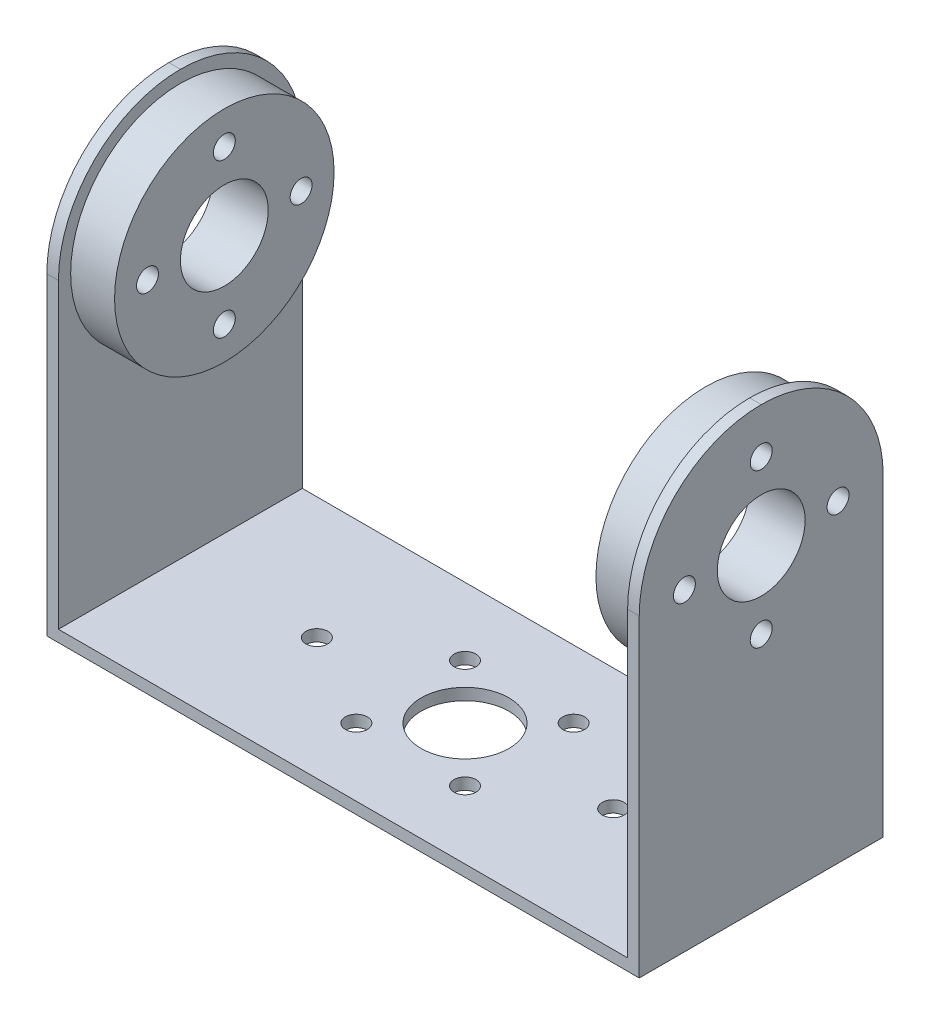
ISO-10303-21;
HEADER;
FILE_DESCRIPTION(('STEP AP214'),'2;1');
FILE_NAME('part.step','',(''),(''),'','','');
FILE_SCHEMA(('AUTOMOTIVE_DESIGN { 1 0 10303 214 1 1 1 1 }'));
ENDSEC;
DATA;
#1=APPLICATION_CONTEXT('core data for automotive mechanical design processes');
#2=APPLICATION_PROTOCOL_DEFINITION('international standard','automotive_design',2000,#1);
#3=PRODUCT_CONTEXT('',#1,'mechanical');
#4=PRODUCT('Part','Part','',(#3));
#5=PRODUCT_RELATED_PRODUCT_CATEGORY('part','',(#4));
#6=PRODUCT_DEFINITION_FORMATION('','',#4);
#7=PRODUCT_DEFINITION_CONTEXT('part definition',#1,'design');
#8=PRODUCT_DEFINITION('design','',#6,#7);
#9=PRODUCT_DEFINITION_SHAPE('','',#8);
#10=(LENGTH_UNIT() NAMED_UNIT(*) SI_UNIT(.MILLI.,.METRE.));
#11=(NAMED_UNIT(*) PLANE_ANGLE_UNIT() SI_UNIT($,.RADIAN.));
#12=(NAMED_UNIT(*) SI_UNIT($,.STERADIAN.) SOLID_ANGLE_UNIT());
#13=UNCERTAINTY_MEASURE_WITH_UNIT(LENGTH_MEASURE(1.E-05),#10,'distance_accuracy_value','');
#14=(GEOMETRIC_REPRESENTATION_CONTEXT(3) GLOBAL_UNCERTAINTY_ASSIGNED_CONTEXT((#13)) GLOBAL_UNIT_ASSIGNED_CONTEXT((#10,
#11,#12)) REPRESENTATION_CONTEXT('',''));
#15=CARTESIAN_POINT('',(0.,0.,0.));
#16=DIRECTION('',(0.,0.,1.));
#17=DIRECTION('',(1.,0.,0.));
#18=AXIS2_PLACEMENT_3D('',#15,#16,#17);
#19=CARTESIAN_POINT('',(1.05833333333333,1.05833333333333,22.225));
#20=DIRECTION('',(-1.,0.,0.));
#21=DIRECTION('',(0.,0.,1.));
#22=AXIS2_PLACEMENT_3D('',#19,#20,#21);
#23=PLANE('',#22);
#24=DIRECTION('',(0.,1.,0.));
#25=VECTOR('',#24,1.);
#26=CARTESIAN_POINT('',(1.05833333333333,1.05833333333333,0.));
#27=LINE('',#26,#25);
#28=CARTESIAN_POINT('',(1.05833333333333,1.05833333333333,0.));
#29=VERTEX_POINT('',#28);
#30=CARTESIAN_POINT('',(1.05833333333333,28.575,0.));
#31=VERTEX_POINT('',#30);
#32=EDGE_CURVE('E120',#29,#31,#27,.T.);
#33=ORIENTED_EDGE('',*,*,#32,.T.);
#34=CARTESIAN_POINT('',(1.05833333333333,28.575,11.1125));
#35=DIRECTION('',(-1.,0.,0.));
#36=DIRECTION('',(0.,0.,1.));
#37=AXIS2_PLACEMENT_3D('',#34,#35,#36);
#38=CIRCLE('',#37,11.1125);
#39=CARTESIAN_POINT('',(1.05833333333333,39.6875,11.1125));
#40=VERTEX_POINT('',#39);
#41=EDGE_CURVE('E176',#31,#40,#38,.F.);
#42=ORIENTED_EDGE('',*,*,#41,.T.);
#43=CARTESIAN_POINT('',(1.05833333333333,28.575,11.1125));
#44=DIRECTION('',(-1.,0.,0.));
#45=DIRECTION('',(0.,0.,1.));
#46=AXIS2_PLACEMENT_3D('',#43,#44,#45);
#47=CIRCLE('',#46,11.1125);
#48=CARTESIAN_POINT('',(1.05833333333333,28.575,22.225));
#49=VERTEX_POINT('',#48);
#50=EDGE_CURVE('E174',#40,#49,#47,.F.);
#51=ORIENTED_EDGE('',*,*,#50,.T.);
#52=DIRECTION('',(0.,1.,0.));
#53=VECTOR('',#52,1.);
#54=CARTESIAN_POINT('',(1.05833333333333,1.05833333333333,22.225));
#55=LINE('',#54,#53);
#56=CARTESIAN_POINT('',(1.05833333333333,1.05833333333333,22.225));
#57=VERTEX_POINT('',#56);
#58=EDGE_CURVE('E144',#57,#49,#55,.T.);
#59=ORIENTED_EDGE('',*,*,#58,.F.);
#60=DIRECTION('',(0.,0.,-1.));
#61=VECTOR('',#60,1.);
#62=CARTESIAN_POINT('',(1.05833333333333,1.05833333333333,22.225));
#63=LINE('',#62,#61);
#64=EDGE_CURVE('E146',#57,#29,#63,.T.);
#65=ORIENTED_EDGE('',*,*,#64,.T.);
#66=EDGE_LOOP('',(#33,#42,#51,#59,#65));
#67=FACE_BOUND('',#66,.T.);
#68=CARTESIAN_POINT('',(1.05833333333333,28.575,11.1125));
#69=DIRECTION('',(-1.,0.,0.));
#70=DIRECTION('',(0.,0.,1.));
#71=AXIS2_PLACEMENT_3D('',#68,#69,#70);
#72=CIRCLE('',#71,10.);
#73=CARTESIAN_POINT('',(1.05833333333333,28.575,21.1125));
#74=VERTEX_POINT('',#73);
#75=EDGE_CURVE('E11',#74,#74,#72,.F.);
#76=ORIENTED_EDGE('',*,*,#75,.F.);
#77=EDGE_LOOP('',(#76));
#78=FACE_BOUND('',#77,.T.);
#79=ADVANCED_FACE('F32',(#67,#78),#23,.F.);
#80=CARTESIAN_POINT('',(0.,39.6875,22.225));
#81=DIRECTION('',(1.,0.,0.));
#82=DIRECTION('',(0.,0.,-1.));
#83=AXIS2_PLACEMENT_3D('',#80,#81,#82);
#84=PLANE('',#83);
#85=CARTESIAN_POINT('',(0.,28.5750000000001,4.1125));
#86=DIRECTION('',(1.,0.,0.));
#87=DIRECTION('',(0.,0.,-1.));
#88=AXIS2_PLACEMENT_3D('',#85,#86,#87);
#89=CIRCLE('',#88,1.);
#90=CARTESIAN_POINT('',(0.,28.5750000000001,3.1125));
#91=VERTEX_POINT('',#90);
#92=EDGE_CURVE('E448',#91,#91,#89,.F.);
#93=ORIENTED_EDGE('',*,*,#92,.F.);
#94=EDGE_LOOP('',(#93));
#95=FACE_BOUND('',#94,.T.);
#96=CARTESIAN_POINT('',(0.,28.575,18.1125));
#97=DIRECTION('',(1.,0.,0.));
#98=DIRECTION('',(0.,0.,-1.));
#99=AXIS2_PLACEMENT_3D('',#96,#97,#98);
#100=CIRCLE('',#99,1.);
#101=CARTESIAN_POINT('',(0.,28.575,17.1125));
#102=VERTEX_POINT('',#101);
#103=EDGE_CURVE('E205',#102,#102,#100,.F.);
#104=ORIENTED_EDGE('',*,*,#103,.F.);
#105=EDGE_LOOP('',(#104));
#106=FACE_BOUND('',#105,.T.);
#107=CARTESIAN_POINT('',(0.,21.575,11.1125));
#108=DIRECTION('',(1.,0.,0.));
#109=DIRECTION('',(0.,0.,-1.));
#110=AXIS2_PLACEMENT_3D('',#107,#108,#109);
#111=CIRCLE('',#110,1.);
#112=CARTESIAN_POINT('',(0.,21.575,10.1125));
#113=VERTEX_POINT('',#112);
#114=EDGE_CURVE('E447',#113,#113,#111,.F.);
#115=ORIENTED_EDGE('',*,*,#114,.F.);
#116=EDGE_LOOP('',(#115));
#117=FACE_BOUND('',#116,.T.);
#118=CARTESIAN_POINT('',(0.,28.575,11.1125));
#119=DIRECTION('',(1.,0.,0.));
#120=DIRECTION('',(0.,0.,-1.));
#121=AXIS2_PLACEMENT_3D('',#118,#119,#120);
#122=CIRCLE('',#121,4.);
#123=CARTESIAN_POINT('',(0.,28.575,7.1125));
#124=VERTEX_POINT('',#123);
#125=EDGE_CURVE('E190',#124,#124,#122,.F.);
#126=ORIENTED_EDGE('',*,*,#125,.F.);
#127=EDGE_LOOP('',(#126));
#128=FACE_BOUND('',#127,.T.);
#129=CARTESIAN_POINT('',(0.,35.575,11.1125));
#130=DIRECTION('',(1.,0.,0.));
#131=DIRECTION('',(0.,0.,-1.));
#132=AXIS2_PLACEMENT_3D('',#129,#130,#131);
#133=CIRCLE('',#132,1.);
#134=CARTESIAN_POINT('',(0.,35.575,10.1125));
#135=VERTEX_POINT('',#134);
#136=EDGE_CURVE('E199',#135,#135,#133,.F.);
#137=ORIENTED_EDGE('',*,*,#136,.F.);
#138=EDGE_LOOP('',(#137));
#139=FACE_BOUND('',#138,.T.);
#140=CARTESIAN_POINT('',(0.,28.575,11.1125));
#141=DIRECTION('',(1.,0.,0.));
#142=DIRECTION('',(0.,0.,-1.));
#143=AXIS2_PLACEMENT_3D('',#140,#141,#142);
#144=CIRCLE('',#143,11.1125);
#145=CARTESIAN_POINT('',(0.,28.575,22.225));
#146=VERTEX_POINT('',#145);
#147=CARTESIAN_POINT('',(0.,39.6875,11.1125));
#148=VERTEX_POINT('',#147);
#149=EDGE_CURVE('E129',#146,#148,#144,.F.);
#150=ORIENTED_EDGE('',*,*,#149,.T.);
#151=CARTESIAN_POINT('',(0.,28.575,11.1125));
#152=DIRECTION('',(1.,0.,0.));
#153=DIRECTION('',(0.,0.,-1.));
#154=AXIS2_PLACEMENT_3D('',#151,#152,#153);
#155=CIRCLE('',#154,11.1125);
#156=CARTESIAN_POINT('',(0.,28.575,0.));
#157=VERTEX_POINT('',#156);
#158=EDGE_CURVE('E166',#148,#157,#155,.F.);
#159=ORIENTED_EDGE('',*,*,#158,.T.);
#160=DIRECTION('',(0.,-1.,0.));
#161=VECTOR('',#160,1.);
#162=CARTESIAN_POINT('',(0.,39.6875,0.));
#163=LINE('',#162,#161);
#164=CARTESIAN_POINT('',(0.,0.,0.));
#165=VERTEX_POINT('',#164);
#166=EDGE_CURVE('E126',#157,#165,#163,.T.);
#167=ORIENTED_EDGE('',*,*,#166,.T.);
#168=DIRECTION('',(0.,0.,-1.));
#169=VECTOR('',#168,1.);
#170=CARTESIAN_POINT('',(0.,0.,22.225));
#171=LINE('',#170,#169);
#172=CARTESIAN_POINT('',(0.,0.,22.225));
#173=VERTEX_POINT('',#172);
#174=EDGE_CURVE('E123',#173,#165,#171,.T.);
#175=ORIENTED_EDGE('',*,*,#174,.F.);
#176=DIRECTION('',(0.,-1.,0.));
#177=VECTOR('',#176,1.);
#178=CARTESIAN_POINT('',(0.,39.6875,22.225));
#179=LINE('',#178,#177);
#180=EDGE_CURVE('E108',#146,#173,#179,.T.);
#181=ORIENTED_EDGE('',*,*,#180,.F.);
#182=EDGE_LOOP('',(#150,#159,#167,#175,#181));
#183=FACE_BOUND('',#182,.T.);
#184=ADVANCED_FACE('F124',(#95,#106,#117,#128,#139,#183),#84,.F.);
#185=CARTESIAN_POINT('',(0.,0.,22.225));
#186=DIRECTION('',(0.,1.,0.));
#187=DIRECTION('',(0.,0.,1.));
#188=AXIS2_PLACEMENT_3D('',#185,#186,#187);
#189=PLANE('',#188);
#190=CARTESIAN_POINT('',(13.4875,0.,11.1125));
#191=DIRECTION('',(0.,-1.,0.));
#192=DIRECTION('',(0.,0.,-1.));
#193=AXIS2_PLACEMENT_3D('',#190,#191,#192);
#194=CIRCLE('',#193,0.999999999999999);
#195=CARTESIAN_POINT('',(13.4875,0.,10.1125));
#196=VERTEX_POINT('',#195);
#197=EDGE_CURVE('E405',#196,#196,#194,.T.);
#198=ORIENTED_EDGE('',*,*,#197,.F.);
#199=EDGE_LOOP('',(#198));
#200=FACE_BOUND('',#199,.T.);
#201=CARTESIAN_POINT('',(40.4875,0.,11.1125));
#202=DIRECTION('',(0.,-1.,0.));
#203=DIRECTION('',(0.,0.,-1.));
#204=AXIS2_PLACEMENT_3D('',#201,#202,#203);
#205=CIRCLE('',#204,0.999999999999998);
#206=CARTESIAN_POINT('',(40.4875,0.,10.1125));
#207=VERTEX_POINT('',#206);
#208=EDGE_CURVE('E404',#207,#207,#205,.T.);
#209=ORIENTED_EDGE('',*,*,#208,.F.);
#210=EDGE_LOOP('',(#209));
#211=FACE_BOUND('',#210,.T.);
#212=CARTESIAN_POINT('',(31.9372474683059,0.,16.0622474683058));
#213=DIRECTION('',(0.,-1.,0.));
#214=DIRECTION('',(0.,0.,1.));
#215=AXIS2_PLACEMENT_3D('',#212,#213,#214);
#216=CIRCLE('',#215,0.999999999999999);
#217=CARTESIAN_POINT('',(31.9372474683059,0.,17.0622474683058));
#218=VERTEX_POINT('',#217);
#219=EDGE_CURVE('E422',#218,#218,#216,.T.);
#220=ORIENTED_EDGE('',*,*,#219,.F.);
#221=EDGE_LOOP('',(#220));
#222=FACE_BOUND('',#221,.T.);
#223=CARTESIAN_POINT('',(31.9372474683058,0.,6.16275253169416));
#224=DIRECTION('',(0.,-1.,0.));
#225=DIRECTION('',(1.,0.,0.));
#226=AXIS2_PLACEMENT_3D('',#223,#224,#225);
#227=CIRCLE('',#226,0.999999999999999);
#228=CARTESIAN_POINT('',(32.9372474683058,0.,6.16275253169417));
#229=VERTEX_POINT('',#228);
#230=EDGE_CURVE('E428',#229,#229,#227,.T.);
#231=ORIENTED_EDGE('',*,*,#230,.F.);
#232=EDGE_LOOP('',(#231));
#233=FACE_BOUND('',#232,.T.);
#234=CARTESIAN_POINT('',(22.0377525316941,0.,16.0622474683058));
#235=DIRECTION('',(0.,-1.,0.));
#236=DIRECTION('',(-1.,0.,0.));
#237=AXIS2_PLACEMENT_3D('',#234,#235,#236);
#238=CIRCLE('',#237,0.999999999999999);
#239=CARTESIAN_POINT('',(21.0377525316941,0.,16.0622474683058));
#240=VERTEX_POINT('',#239);
#241=EDGE_CURVE('E412',#240,#240,#238,.T.);
#242=ORIENTED_EDGE('',*,*,#241,.F.);
#243=EDGE_LOOP('',(#242));
#244=FACE_BOUND('',#243,.T.);
#245=CARTESIAN_POINT('',(22.0377525316941,0.,6.16275253169419));
#246=DIRECTION('',(0.,-1.,0.));
#247=DIRECTION('',(0.,0.,-1.));
#248=AXIS2_PLACEMENT_3D('',#245,#246,#247);
#249=CIRCLE('',#248,0.999999999999999);
#250=CARTESIAN_POINT('',(22.0377525316941,0.,5.16275253169419));
#251=VERTEX_POINT('',#250);
#252=EDGE_CURVE('E434',#251,#251,#249,.T.);
#253=ORIENTED_EDGE('',*,*,#252,.F.);
#254=EDGE_LOOP('',(#253));
#255=FACE_BOUND('',#254,.T.);
#256=CARTESIAN_POINT('',(26.9875,0.,11.1125));
#257=DIRECTION('',(0.,-1.,0.));
#258=DIRECTION('',(0.,0.,-1.));
#259=AXIS2_PLACEMENT_3D('',#256,#257,#258);
#260=CIRCLE('',#259,4.);
#261=CARTESIAN_POINT('',(26.9875,0.,7.1125));
#262=VERTEX_POINT('',#261);
#263=EDGE_CURVE('E440',#262,#262,#260,.T.);
#264=ORIENTED_EDGE('',*,*,#263,.F.);
#265=EDGE_LOOP('',(#264));
#266=FACE_BOUND('',#265,.T.);
#267=DIRECTION('',(1.,0.,0.));
#268=VECTOR('',#267,1.);
#269=CARTESIAN_POINT('',(0.,0.,0.));
#270=LINE('',#269,#268);
#271=CARTESIAN_POINT('',(53.975,0.,0.));
#272=VERTEX_POINT('',#271);
#273=EDGE_CURVE('E148',#165,#272,#270,.T.);
#274=ORIENTED_EDGE('',*,*,#273,.T.);
#275=DIRECTION('',(0.,0.,-1.));
#276=VECTOR('',#275,1.);
#277=CARTESIAN_POINT('',(53.975,0.,22.225));
#278=LINE('',#277,#276);
#279=CARTESIAN_POINT('',(53.975,0.,22.225));
#280=VERTEX_POINT('',#279);
#281=EDGE_CURVE('E130',#280,#272,#278,.T.);
#282=ORIENTED_EDGE('',*,*,#281,.F.);
#283=DIRECTION('',(1.,0.,0.));
#284=VECTOR('',#283,1.);
#285=CARTESIAN_POINT('',(0.,0.,22.225));
#286=LINE('',#285,#284);
#287=EDGE_CURVE('E114',#173,#280,#286,.T.);
#288=ORIENTED_EDGE('',*,*,#287,.F.);
#289=ORIENTED_EDGE('',*,*,#174,.T.);
#290=EDGE_LOOP('',(#274,#282,#288,#289));
#291=FACE_BOUND('',#290,.T.);
#292=ADVANCED_FACE('F132',(#200,#211,#222,#233,#244,#255,#266,#291),#189,.F.);
#293=CARTESIAN_POINT('',(53.975,0.,22.225));
#294=DIRECTION('',(-1.,0.,0.));
#295=DIRECTION('',(0.,0.,1.));
#296=AXIS2_PLACEMENT_3D('',#293,#294,#295);
#297=PLANE('',#296);
#298=CARTESIAN_POINT('',(53.975,28.5750000000001,4.1125));
#299=DIRECTION('',(1.,0.,0.));
#300=DIRECTION('',(0.,-1.,0.));
#301=AXIS2_PLACEMENT_3D('',#298,#299,#300);
#302=CIRCLE('',#301,1.);
#303=CARTESIAN_POINT('',(53.975,27.5750000000001,4.11249999999999));
#304=VERTEX_POINT('',#303);
#305=EDGE_CURVE('E349',#304,#304,#302,.T.);
#306=ORIENTED_EDGE('',*,*,#305,.F.);
#307=EDGE_LOOP('',(#306));
#308=FACE_BOUND('',#307,.T.);
#309=CARTESIAN_POINT('',(53.975,28.575,18.1125));
#310=DIRECTION('',(1.,0.,0.));
#311=DIRECTION('',(0.,1.,0.));
#312=AXIS2_PLACEMENT_3D('',#309,#310,#311);
#313=CIRCLE('',#312,1.);
#314=CARTESIAN_POINT('',(53.975,29.575,18.1125));
#315=VERTEX_POINT('',#314);
#316=EDGE_CURVE('E353',#315,#315,#313,.T.);
#317=ORIENTED_EDGE('',*,*,#316,.F.);
#318=EDGE_LOOP('',(#317));
#319=FACE_BOUND('',#318,.T.);
#320=CARTESIAN_POINT('',(53.975,21.575,11.1125));
#321=DIRECTION('',(1.,0.,0.));
#322=DIRECTION('',(0.,0.,1.));
#323=AXIS2_PLACEMENT_3D('',#320,#321,#322);
#324=CIRCLE('',#323,1.);
#325=CARTESIAN_POINT('',(53.975,21.575,12.1125));
#326=VERTEX_POINT('',#325);
#327=EDGE_CURVE('E357',#326,#326,#324,.T.);
#328=ORIENTED_EDGE('',*,*,#327,.F.);
#329=EDGE_LOOP('',(#328));
#330=FACE_BOUND('',#329,.T.);
#331=CARTESIAN_POINT('',(53.975,28.575,11.1125));
#332=DIRECTION('',(1.,0.,0.));
#333=DIRECTION('',(0.,0.,-1.));
#334=AXIS2_PLACEMENT_3D('',#331,#332,#333);
#335=CIRCLE('',#334,4.);
#336=CARTESIAN_POINT('',(53.975,28.575,7.1125));
#337=VERTEX_POINT('',#336);
#338=EDGE_CURVE('E194',#337,#337,#335,.T.);
#339=ORIENTED_EDGE('',*,*,#338,.F.);
#340=EDGE_LOOP('',(#339));
#341=FACE_BOUND('',#340,.T.);
#342=CARTESIAN_POINT('',(53.975,35.575,11.1125));
#343=DIRECTION('',(1.,0.,0.));
#344=DIRECTION('',(0.,0.,-1.));
#345=AXIS2_PLACEMENT_3D('',#342,#343,#344);
#346=CIRCLE('',#345,1.);
#347=CARTESIAN_POINT('',(53.975,35.575,10.1125));
#348=VERTEX_POINT('',#347);
#349=EDGE_CURVE('E203',#348,#348,#346,.T.);
#350=ORIENTED_EDGE('',*,*,#349,.F.);
#351=EDGE_LOOP('',(#350));
#352=FACE_BOUND('',#351,.T.);
#353=DIRECTION('',(0.,1.,0.));
#354=VECTOR('',#353,1.);
#355=CARTESIAN_POINT('',(53.975,0.,0.));
#356=LINE('',#355,#354);
#357=CARTESIAN_POINT('',(53.975,28.575,0.));
#358=VERTEX_POINT('',#357);
#359=EDGE_CURVE('E151',#272,#358,#356,.T.);
#360=ORIENTED_EDGE('',*,*,#359,.T.);
#361=CARTESIAN_POINT('',(53.975,28.575,11.1125));
#362=DIRECTION('',(-1.,0.,0.));
#363=DIRECTION('',(0.,0.,1.));
#364=AXIS2_PLACEMENT_3D('',#361,#362,#363);
#365=CIRCLE('',#364,11.1125);
#366=CARTESIAN_POINT('',(53.975,39.6875,11.1125));
#367=VERTEX_POINT('',#366);
#368=EDGE_CURVE('E40',#358,#367,#365,.F.);
#369=ORIENTED_EDGE('',*,*,#368,.T.);
#370=CARTESIAN_POINT('',(53.975,28.575,11.1125));
#371=DIRECTION('',(-1.,0.,0.));
#372=DIRECTION('',(0.,0.,1.));
#373=AXIS2_PLACEMENT_3D('',#370,#371,#372);
#374=CIRCLE('',#373,11.1125);
#375=CARTESIAN_POINT('',(53.975,28.575,22.225));
#376=VERTEX_POINT('',#375);
#377=EDGE_CURVE('E184',#367,#376,#374,.F.);
#378=ORIENTED_EDGE('',*,*,#377,.T.);
#379=DIRECTION('',(0.,1.,0.));
#380=VECTOR('',#379,1.);
#381=CARTESIAN_POINT('',(53.975,0.,22.225));
#382=LINE('',#381,#380);
#383=EDGE_CURVE('E135',#280,#376,#382,.T.);
#384=ORIENTED_EDGE('',*,*,#383,.F.);
#385=ORIENTED_EDGE('',*,*,#281,.T.);
#386=EDGE_LOOP('',(#360,#369,#378,#384,#385));
#387=FACE_BOUND('',#386,.T.);
#388=ADVANCED_FACE('F219',(#308,#319,#330,#341,#352,#387),#297,.F.);
#389=CARTESIAN_POINT('',(52.9166666666667,39.6875,22.225));
#390=DIRECTION('',(1.,0.,0.));
#391=DIRECTION('',(0.,1.,0.));
#392=AXIS2_PLACEMENT_3D('',#389,#390,#391);
#393=PLANE('',#392);
#394=CARTESIAN_POINT('',(52.9166666666667,28.575,11.1125));
#395=DIRECTION('',(1.,0.,0.));
#396=DIRECTION('',(0.,0.,-1.));
#397=AXIS2_PLACEMENT_3D('',#394,#395,#396);
#398=CIRCLE('',#397,10.);
#399=CARTESIAN_POINT('',(52.9166666666667,28.575,1.1125));
#400=VERTEX_POINT('',#399);
#401=EDGE_CURVE('E380',#400,#400,#398,.T.);
#402=ORIENTED_EDGE('',*,*,#401,.T.);
#403=EDGE_LOOP('',(#402));
#404=FACE_BOUND('',#403,.T.);
#405=CARTESIAN_POINT('',(52.9166666666667,28.575,11.1125));
#406=DIRECTION('',(1.,0.,0.));
#407=DIRECTION('',(0.,1.,0.));
#408=AXIS2_PLACEMENT_3D('',#405,#406,#407);
#409=CIRCLE('',#408,11.1125);
#410=CARTESIAN_POINT('',(52.9166666666667,28.575,22.225));
#411=VERTEX_POINT('',#410);
#412=CARTESIAN_POINT('',(52.9166666666667,39.6875,11.1125));
#413=VERTEX_POINT('',#412);
#414=EDGE_CURVE('E54',#411,#413,#409,.F.);
#415=ORIENTED_EDGE('',*,*,#414,.T.);
#416=CARTESIAN_POINT('',(52.9166666666667,28.575,11.1125));
#417=DIRECTION('',(1.,0.,0.));
#418=DIRECTION('',(0.,1.,0.));
#419=AXIS2_PLACEMENT_3D('',#416,#417,#418);
#420=CIRCLE('',#419,11.1125);
#421=CARTESIAN_POINT('',(52.9166666666667,28.575,0.));
#422=VERTEX_POINT('',#421);
#423=EDGE_CURVE('E182',#413,#422,#420,.F.);
#424=ORIENTED_EDGE('',*,*,#423,.T.);
#425=DIRECTION('',(0.,-1.,0.));
#426=VECTOR('',#425,1.);
#427=CARTESIAN_POINT('',(52.9166666666667,39.6875,0.));
#428=LINE('',#427,#426);
#429=CARTESIAN_POINT('',(52.9166666666667,1.05833333333333,0.));
#430=VERTEX_POINT('',#429);
#431=EDGE_CURVE('E153',#422,#430,#428,.T.);
#432=ORIENTED_EDGE('',*,*,#431,.T.);
#433=DIRECTION('',(0.,0.,-1.));
#434=VECTOR('',#433,1.);
#435=CARTESIAN_POINT('',(52.9166666666667,1.05833333333333,22.225));
#436=LINE('',#435,#434);
#437=CARTESIAN_POINT('',(52.9166666666667,1.05833333333333,22.225));
#438=VERTEX_POINT('',#437);
#439=EDGE_CURVE('E161',#438,#430,#436,.T.);
#440=ORIENTED_EDGE('',*,*,#439,.F.);
#441=DIRECTION('',(0.,-1.,0.));
#442=VECTOR('',#441,1.);
#443=CARTESIAN_POINT('',(52.9166666666667,39.6875,22.225));
#444=LINE('',#443,#442);
#445=EDGE_CURVE('E137',#411,#438,#444,.T.);
#446=ORIENTED_EDGE('',*,*,#445,.F.);
#447=EDGE_LOOP('',(#415,#424,#432,#440,#446));
#448=FACE_BOUND('',#447,.T.);
#449=ADVANCED_FACE('F252',(#404,#448),#393,.F.);
#450=CARTESIAN_POINT('',(52.9166666666667,1.05833333333333,22.225));
#451=DIRECTION('',(0.,-1.,0.));
#452=DIRECTION('',(1.,0.,0.));
#453=AXIS2_PLACEMENT_3D('',#450,#451,#452);
#454=PLANE('',#453);
#455=CARTESIAN_POINT('',(13.4875,1.05833333333333,11.1125));
#456=DIRECTION('',(0.,-1.,0.));
#457=DIRECTION('',(1.,0.,0.));
#458=AXIS2_PLACEMENT_3D('',#455,#456,#457);
#459=CIRCLE('',#458,0.999999999999999);
#460=CARTESIAN_POINT('',(14.4875,1.05833333333333,11.1125));
#461=VERTEX_POINT('',#460);
#462=EDGE_CURVE('E408',#461,#461,#459,.F.);
#463=ORIENTED_EDGE('',*,*,#462,.F.);
#464=EDGE_LOOP('',(#463));
#465=FACE_BOUND('',#464,.T.);
#466=CARTESIAN_POINT('',(40.4875,1.05833333333333,11.1125));
#467=DIRECTION('',(0.,-1.,0.));
#468=DIRECTION('',(1.,0.,0.));
#469=AXIS2_PLACEMENT_3D('',#466,#467,#468);
#470=CIRCLE('',#469,0.999999999999998);
#471=CARTESIAN_POINT('',(41.4875,1.05833333333333,11.1125));
#472=VERTEX_POINT('',#471);
#473=EDGE_CURVE('E409',#472,#472,#470,.F.);
#474=ORIENTED_EDGE('',*,*,#473,.F.);
#475=EDGE_LOOP('',(#474));
#476=FACE_BOUND('',#475,.T.);
#477=CARTESIAN_POINT('',(31.9372474683059,1.05833333333333,16.0622474683058));
#478=DIRECTION('',(0.,-1.,0.));
#479=DIRECTION('',(1.,0.,0.));
#480=AXIS2_PLACEMENT_3D('',#477,#478,#479);
#481=CIRCLE('',#480,0.999999999999999);
#482=CARTESIAN_POINT('',(32.9372474683059,1.05833333333333,16.0622474683058));
#483=VERTEX_POINT('',#482);
#484=EDGE_CURVE('E425',#483,#483,#481,.F.);
#485=ORIENTED_EDGE('',*,*,#484,.F.);
#486=EDGE_LOOP('',(#485));
#487=FACE_BOUND('',#486,.T.);
#488=CARTESIAN_POINT('',(31.9372474683058,1.05833333333333,6.16275253169416));
#489=DIRECTION('',(0.,-1.,0.));
#490=DIRECTION('',(1.,0.,0.));
#491=AXIS2_PLACEMENT_3D('',#488,#489,#490);
#492=CIRCLE('',#491,0.999999999999999);
#493=CARTESIAN_POINT('',(32.9372474683058,1.05833333333333,6.16275253169416));
#494=VERTEX_POINT('',#493);
#495=EDGE_CURVE('E431',#494,#494,#492,.F.);
#496=ORIENTED_EDGE('',*,*,#495,.F.);
#497=EDGE_LOOP('',(#496));
#498=FACE_BOUND('',#497,.T.);
#499=CARTESIAN_POINT('',(22.0377525316941,1.05833333333333,16.0622474683058));
#500=DIRECTION('',(0.,-1.,0.));
#501=DIRECTION('',(1.,0.,0.));
#502=AXIS2_PLACEMENT_3D('',#499,#500,#501);
#503=CIRCLE('',#502,0.999999999999999);
#504=CARTESIAN_POINT('',(23.0377525316941,1.05833333333333,16.0622474683058));
#505=VERTEX_POINT('',#504);
#506=EDGE_CURVE('E419',#505,#505,#503,.F.);
#507=ORIENTED_EDGE('',*,*,#506,.F.);
#508=EDGE_LOOP('',(#507));
#509=FACE_BOUND('',#508,.T.);
#510=CARTESIAN_POINT('',(22.0377525316941,1.05833333333333,6.16275253169419));
#511=DIRECTION('',(0.,-1.,0.));
#512=DIRECTION('',(1.,0.,0.));
#513=AXIS2_PLACEMENT_3D('',#510,#511,#512);
#514=CIRCLE('',#513,0.999999999999999);
#515=CARTESIAN_POINT('',(23.0377525316941,1.05833333333333,6.16275253169419));
#516=VERTEX_POINT('',#515);
#517=EDGE_CURVE('E437',#516,#516,#514,.F.);
#518=ORIENTED_EDGE('',*,*,#517,.F.);
#519=EDGE_LOOP('',(#518));
#520=FACE_BOUND('',#519,.T.);
#521=CARTESIAN_POINT('',(26.9875,1.05833333333333,11.1125));
#522=DIRECTION('',(0.,-1.,0.));
#523=DIRECTION('',(1.,0.,0.));
#524=AXIS2_PLACEMENT_3D('',#521,#522,#523);
#525=CIRCLE('',#524,4.);
#526=CARTESIAN_POINT('',(30.9875,1.05833333333333,11.1125));
#527=VERTEX_POINT('',#526);
#528=EDGE_CURVE('E443',#527,#527,#525,.F.);
#529=ORIENTED_EDGE('',*,*,#528,.F.);
#530=EDGE_LOOP('',(#529));
#531=FACE_BOUND('',#530,.T.);
#532=DIRECTION('',(-1.,0.,0.));
#533=VECTOR('',#532,1.);
#534=CARTESIAN_POINT('',(52.9166666666667,1.05833333333333,0.));
#535=LINE('',#534,#533);
#536=EDGE_CURVE('E155',#430,#29,#535,.T.);
#537=ORIENTED_EDGE('',*,*,#536,.T.);
#538=ORIENTED_EDGE('',*,*,#64,.F.);
#539=DIRECTION('',(-1.,0.,0.));
#540=VECTOR('',#539,1.);
#541=CARTESIAN_POINT('',(52.9166666666667,1.05833333333333,22.225));
#542=LINE('',#541,#540);
#543=EDGE_CURVE('E142',#438,#57,#542,.T.);
#544=ORIENTED_EDGE('',*,*,#543,.F.);
#545=ORIENTED_EDGE('',*,*,#439,.T.);
#546=EDGE_LOOP('',(#537,#538,#544,#545));
#547=FACE_BOUND('',#546,.T.);
#548=ADVANCED_FACE('F256',(#465,#476,#487,#498,#509,#520,#531,#547),#454,.F.);
#549=CARTESIAN_POINT('',(0.,0.,22.225));
#550=DIRECTION('',(0.,0.,1.));
#551=DIRECTION('',(1.,0.,0.));
#552=AXIS2_PLACEMENT_3D('',#549,#550,#551);
#553=PLANE('',#552);
#554=ORIENTED_EDGE('',*,*,#58,.T.);
#555=DIRECTION('',(-1.,0.,0.));
#556=VECTOR('',#555,1.);
#557=CARTESIAN_POINT('',(0.,28.575,22.225));
#558=LINE('',#557,#556);
#559=EDGE_CURVE('E117',#49,#146,#558,.T.);
#560=ORIENTED_EDGE('',*,*,#559,.T.);
#561=ORIENTED_EDGE('',*,*,#180,.T.);
#562=ORIENTED_EDGE('',*,*,#287,.T.);
#563=ORIENTED_EDGE('',*,*,#383,.T.);
#564=DIRECTION('',(-1.,0.,0.));
#565=VECTOR('',#564,1.);
#566=CARTESIAN_POINT('',(52.9166666666667,28.575,22.225));
#567=LINE('',#566,#565);
#568=EDGE_CURVE('E178',#376,#411,#567,.T.);
#569=ORIENTED_EDGE('',*,*,#568,.T.);
#570=ORIENTED_EDGE('',*,*,#445,.T.);
#571=ORIENTED_EDGE('',*,*,#543,.T.);
#572=EDGE_LOOP('',(#554,#560,#561,#562,#563,#569,#570,#571));
#573=FACE_BOUND('',#572,.T.);
#574=ADVANCED_FACE('F111',(#573),#553,.T.);
#575=CARTESIAN_POINT('',(0.,0.,0.));
#576=DIRECTION('',(0.,0.,1.));
#577=DIRECTION('',(1.,0.,0.));
#578=AXIS2_PLACEMENT_3D('',#575,#576,#577);
#579=PLANE('',#578);
#580=ORIENTED_EDGE('',*,*,#166,.F.);
#581=DIRECTION('',(-1.,0.,0.));
#582=VECTOR('',#581,1.);
#583=CARTESIAN_POINT('',(1.87350135405495E-13,28.575,0.));
#584=LINE('',#583,#582);
#585=EDGE_CURVE('E171',#157,#31,#584,.F.);
#586=ORIENTED_EDGE('',*,*,#585,.T.);
#587=ORIENTED_EDGE('',*,*,#32,.F.);
#588=ORIENTED_EDGE('',*,*,#536,.F.);
#589=ORIENTED_EDGE('',*,*,#431,.F.);
#590=DIRECTION('',(-1.,0.,0.));
#591=VECTOR('',#590,1.);
#592=CARTESIAN_POINT('',(0.,28.575,0.));
#593=LINE('',#592,#591);
#594=EDGE_CURVE('E168',#422,#358,#593,.F.);
#595=ORIENTED_EDGE('',*,*,#594,.T.);
#596=ORIENTED_EDGE('',*,*,#359,.F.);
#597=ORIENTED_EDGE('',*,*,#273,.F.);
#598=EDGE_LOOP('',(#580,#586,#587,#588,#589,#595,#596,#597));
#599=FACE_BOUND('',#598,.T.);
#600=ADVANCED_FACE('F234',(#599),#579,.F.);
#601=CARTESIAN_POINT('',(1.87350135405495E-13,28.575,11.1125));
#602=DIRECTION('',(1.,0.,0.));
#603=DIRECTION('',(0.,1.,0.));
#604=AXIS2_PLACEMENT_3D('',#601,#602,#603);
#605=CYLINDRICAL_SURFACE('',#604,11.1125);
#606=ORIENTED_EDGE('',*,*,#559,.F.);
#607=ORIENTED_EDGE('',*,*,#50,.F.);
#608=DIRECTION('',(-1.,0.,0.));
#609=VECTOR('',#608,1.);
#610=CARTESIAN_POINT('',(1.05833333333333,39.6875,11.1125));
#611=LINE('',#610,#609);
#612=EDGE_CURVE('E149',#148,#40,#611,.F.);
#613=ORIENTED_EDGE('',*,*,#612,.F.);
#614=ORIENTED_EDGE('',*,*,#149,.F.);
#615=EDGE_LOOP('',(#606,#607,#613,#614));
#616=FACE_BOUND('',#615,.T.);
#617=ADVANCED_FACE('F231',(#616),#605,.T.);
#618=CARTESIAN_POINT('',(1.05833333333326,28.575,11.1125));
#619=DIRECTION('',(-1.,0.,0.));
#620=DIRECTION('',(0.,-1.,0.));
#621=AXIS2_PLACEMENT_3D('',#618,#619,#620);
#622=CYLINDRICAL_SURFACE('',#621,11.1125);
#623=ORIENTED_EDGE('',*,*,#41,.F.);
#624=ORIENTED_EDGE('',*,*,#585,.F.);
#625=ORIENTED_EDGE('',*,*,#158,.F.);
#626=ORIENTED_EDGE('',*,*,#612,.T.);
#627=EDGE_LOOP('',(#623,#624,#625,#626));
#628=FACE_BOUND('',#627,.T.);
#629=ADVANCED_FACE('F228',(#628),#622,.T.);
#630=CARTESIAN_POINT('',(0.,28.575,11.1125));
#631=DIRECTION('',(1.,0.,0.));
#632=DIRECTION('',(0.,0.,-1.));
#633=AXIS2_PLACEMENT_3D('',#630,#631,#632);
#634=CYLINDRICAL_SURFACE('',#633,11.1125);
#635=ORIENTED_EDGE('',*,*,#568,.F.);
#636=ORIENTED_EDGE('',*,*,#377,.F.);
#637=DIRECTION('',(-1.,0.,0.));
#638=VECTOR('',#637,1.);
#639=CARTESIAN_POINT('',(53.975,39.6875,11.1125));
#640=LINE('',#639,#638);
#641=EDGE_CURVE('E188',#413,#367,#640,.F.);
#642=ORIENTED_EDGE('',*,*,#641,.F.);
#643=ORIENTED_EDGE('',*,*,#414,.F.);
#644=EDGE_LOOP('',(#635,#636,#642,#643));
#645=FACE_BOUND('',#644,.T.);
#646=ADVANCED_FACE('F34',(#645),#634,.T.);
#647=CARTESIAN_POINT('',(53.975,28.575,11.1125));
#648=DIRECTION('',(-1.,0.,0.));
#649=DIRECTION('',(0.,0.,1.));
#650=AXIS2_PLACEMENT_3D('',#647,#648,#649);
#651=CYLINDRICAL_SURFACE('',#650,11.1125);
#652=ORIENTED_EDGE('',*,*,#368,.F.);
#653=ORIENTED_EDGE('',*,*,#594,.F.);
#654=ORIENTED_EDGE('',*,*,#423,.F.);
#655=ORIENTED_EDGE('',*,*,#641,.T.);
#656=EDGE_LOOP('',(#652,#653,#654,#655));
#657=FACE_BOUND('',#656,.T.);
#658=ADVANCED_FACE('F236',(#657),#651,.T.);
#659=CARTESIAN_POINT('',(-11.3137084989848,35.575,11.1125));
#660=DIRECTION('',(1.,0.,0.));
#661=DIRECTION('',(0.,0.,-1.));
#662=AXIS2_PLACEMENT_3D('',#659,#660,#661);
#663=CYLINDRICAL_SURFACE('',#662,1.);
#664=ORIENTED_EDGE('',*,*,#136,.T.);
#665=EDGE_LOOP('',(#664));
#666=FACE_BOUND('',#665,.T.);
#667=CARTESIAN_POINT('',(5.05833333333333,35.575,11.1125));
#668=DIRECTION('',(1.,0.,0.));
#669=DIRECTION('',(0.,0.,-1.));
#670=AXIS2_PLACEMENT_3D('',#667,#668,#669);
#671=CIRCLE('',#670,1.);
#672=CARTESIAN_POINT('',(5.05833333333333,35.575,10.1125));
#673=VERTEX_POINT('',#672);
#674=EDGE_CURVE('E389',#673,#673,#671,.T.);
#675=ORIENTED_EDGE('',*,*,#674,.T.);
#676=EDGE_LOOP('',(#675));
#677=FACE_BOUND('',#676,.T.);
#678=ADVANCED_FACE('F209',(#666,#677),#663,.F.);
#679=CARTESIAN_POINT('',(-11.3137084989848,28.575,11.1125));
#680=DIRECTION('',(1.,0.,0.));
#681=DIRECTION('',(0.,0.,-1.));
#682=AXIS2_PLACEMENT_3D('',#679,#680,#681);
#683=CYLINDRICAL_SURFACE('',#682,4.);
#684=ORIENTED_EDGE('',*,*,#125,.T.);
#685=EDGE_LOOP('',(#684));
#686=FACE_BOUND('',#685,.T.);
#687=CARTESIAN_POINT('',(5.05833333333333,28.575,11.1125));
#688=DIRECTION('',(1.,0.,0.));
#689=DIRECTION('',(0.,0.,-1.));
#690=AXIS2_PLACEMENT_3D('',#687,#688,#689);
#691=CIRCLE('',#690,4.);
#692=CARTESIAN_POINT('',(5.05833333333333,28.575,7.1125));
#693=VERTEX_POINT('',#692);
#694=EDGE_CURVE('E384',#693,#693,#691,.T.);
#695=ORIENTED_EDGE('',*,*,#694,.T.);
#696=EDGE_LOOP('',(#695));
#697=FACE_BOUND('',#696,.T.);
#698=ADVANCED_FACE('F242',(#686,#697),#683,.F.);
#699=ORIENTED_EDGE('',*,*,#349,.T.);
#700=EDGE_LOOP('',(#699));
#701=FACE_BOUND('',#700,.T.);
#702=CARTESIAN_POINT('',(48.9166666666667,35.575,11.1125));
#703=DIRECTION('',(1.,0.,0.));
#704=DIRECTION('',(0.,0.,-1.));
#705=AXIS2_PLACEMENT_3D('',#702,#703,#704);
#706=CIRCLE('',#705,1.);
#707=CARTESIAN_POINT('',(48.9166666666667,35.575,10.1125));
#708=VERTEX_POINT('',#707);
#709=EDGE_CURVE('E364',#708,#708,#706,.T.);
#710=ORIENTED_EDGE('',*,*,#709,.F.);
#711=EDGE_LOOP('',(#710));
#712=FACE_BOUND('',#711,.T.);
#713=ADVANCED_FACE('F244',(#701,#712),#663,.F.);
#714=ORIENTED_EDGE('',*,*,#338,.T.);
#715=EDGE_LOOP('',(#714));
#716=FACE_BOUND('',#715,.T.);
#717=CARTESIAN_POINT('',(48.9166666666667,28.575,11.1125));
#718=DIRECTION('',(1.,0.,0.));
#719=DIRECTION('',(0.,0.,-1.));
#720=AXIS2_PLACEMENT_3D('',#717,#718,#719);
#721=CIRCLE('',#720,4.);
#722=CARTESIAN_POINT('',(48.9166666666667,28.575,7.1125));
#723=VERTEX_POINT('',#722);
#724=EDGE_CURVE('E367',#723,#723,#721,.T.);
#725=ORIENTED_EDGE('',*,*,#724,.F.);
#726=EDGE_LOOP('',(#725));
#727=FACE_BOUND('',#726,.T.);
#728=ADVANCED_FACE('F327',(#716,#727),#683,.F.);
#729=CARTESIAN_POINT('',(-11.3137084989848,21.575,11.1125));
#730=DIRECTION('',(1.,0.,0.));
#731=DIRECTION('',(0.,0.,-1.));
#732=AXIS2_PLACEMENT_3D('',#729,#730,#731);
#733=CYLINDRICAL_SURFACE('',#732,1.);
#734=ORIENTED_EDGE('',*,*,#114,.T.);
#735=EDGE_LOOP('',(#734));
#736=FACE_BOUND('',#735,.T.);
#737=CARTESIAN_POINT('',(5.05833333333333,21.575,11.1125));
#738=DIRECTION('',(1.,0.,0.));
#739=DIRECTION('',(0.,0.,-1.));
#740=AXIS2_PLACEMENT_3D('',#737,#738,#739);
#741=CIRCLE('',#740,1.);
#742=CARTESIAN_POINT('',(5.05833333333333,21.575,10.1125));
#743=VERTEX_POINT('',#742);
#744=EDGE_CURVE('E395',#743,#743,#741,.T.);
#745=ORIENTED_EDGE('',*,*,#744,.T.);
#746=EDGE_LOOP('',(#745));
#747=FACE_BOUND('',#746,.T.);
#748=ADVANCED_FACE('F319',(#736,#747),#733,.F.);
#749=CARTESIAN_POINT('',(-11.3137084989848,28.575,18.1125));
#750=DIRECTION('',(1.,0.,0.));
#751=DIRECTION('',(0.,0.,-1.));
#752=AXIS2_PLACEMENT_3D('',#749,#750,#751);
#753=CYLINDRICAL_SURFACE('',#752,1.);
#754=ORIENTED_EDGE('',*,*,#103,.T.);
#755=EDGE_LOOP('',(#754));
#756=FACE_BOUND('',#755,.T.);
#757=CARTESIAN_POINT('',(5.05833333333333,28.575,18.1125));
#758=DIRECTION('',(1.,0.,0.));
#759=DIRECTION('',(0.,0.,-1.));
#760=AXIS2_PLACEMENT_3D('',#757,#758,#759);
#761=CIRCLE('',#760,1.);
#762=CARTESIAN_POINT('',(5.05833333333333,28.575,17.1125));
#763=VERTEX_POINT('',#762);
#764=EDGE_CURVE('E398',#763,#763,#761,.T.);
#765=ORIENTED_EDGE('',*,*,#764,.T.);
#766=EDGE_LOOP('',(#765));
#767=FACE_BOUND('',#766,.T.);
#768=ADVANCED_FACE('F323',(#756,#767),#753,.F.);
#769=CARTESIAN_POINT('',(-11.3137084989848,28.5750000000001,4.1125));
#770=DIRECTION('',(1.,0.,0.));
#771=DIRECTION('',(0.,0.,-1.));
#772=AXIS2_PLACEMENT_3D('',#769,#770,#771);
#773=CYLINDRICAL_SURFACE('',#772,1.);
#774=ORIENTED_EDGE('',*,*,#92,.T.);
#775=EDGE_LOOP('',(#774));
#776=FACE_BOUND('',#775,.T.);
#777=CARTESIAN_POINT('',(5.05833333333333,28.5750000000001,4.1125));
#778=DIRECTION('',(1.,0.,0.));
#779=DIRECTION('',(0.,0.,-1.));
#780=AXIS2_PLACEMENT_3D('',#777,#778,#779);
#781=CIRCLE('',#780,1.);
#782=CARTESIAN_POINT('',(5.05833333333333,28.5750000000001,3.1125));
#783=VERTEX_POINT('',#782);
#784=EDGE_CURVE('E392',#783,#783,#781,.T.);
#785=ORIENTED_EDGE('',*,*,#784,.T.);
#786=EDGE_LOOP('',(#785));
#787=FACE_BOUND('',#786,.T.);
#788=ADVANCED_FACE('F317',(#776,#787),#773,.F.);
#789=ORIENTED_EDGE('',*,*,#327,.T.);
#790=EDGE_LOOP('',(#789));
#791=FACE_BOUND('',#790,.T.);
#792=CARTESIAN_POINT('',(48.9166666666667,21.575,11.1125));
#793=DIRECTION('',(1.,0.,0.));
#794=DIRECTION('',(0.,0.,-1.));
#795=AXIS2_PLACEMENT_3D('',#792,#793,#794);
#796=CIRCLE('',#795,1.);
#797=CARTESIAN_POINT('',(48.9166666666667,21.575,10.1125));
#798=VERTEX_POINT('',#797);
#799=EDGE_CURVE('E370',#798,#798,#796,.T.);
#800=ORIENTED_EDGE('',*,*,#799,.F.);
#801=EDGE_LOOP('',(#800));
#802=FACE_BOUND('',#801,.T.);
#803=ADVANCED_FACE('F313',(#791,#802),#733,.F.);
#804=ORIENTED_EDGE('',*,*,#316,.T.);
#805=EDGE_LOOP('',(#804));
#806=FACE_BOUND('',#805,.T.);
#807=CARTESIAN_POINT('',(48.9166666666667,28.575,18.1125));
#808=DIRECTION('',(1.,0.,0.));
#809=DIRECTION('',(0.,0.,-1.));
#810=AXIS2_PLACEMENT_3D('',#807,#808,#809);
#811=CIRCLE('',#810,1.);
#812=CARTESIAN_POINT('',(48.9166666666667,28.575,17.1125));
#813=VERTEX_POINT('',#812);
#814=EDGE_CURVE('E377',#813,#813,#811,.T.);
#815=ORIENTED_EDGE('',*,*,#814,.F.);
#816=EDGE_LOOP('',(#815));
#817=FACE_BOUND('',#816,.T.);
#818=ADVANCED_FACE('F316',(#806,#817),#753,.F.);
#819=ORIENTED_EDGE('',*,*,#305,.T.);
#820=EDGE_LOOP('',(#819));
#821=FACE_BOUND('',#820,.T.);
#822=CARTESIAN_POINT('',(48.9166666666667,28.5750000000001,4.1125));
#823=DIRECTION('',(1.,0.,0.));
#824=DIRECTION('',(0.,0.,-1.));
#825=AXIS2_PLACEMENT_3D('',#822,#823,#824);
#826=CIRCLE('',#825,1.);
#827=CARTESIAN_POINT('',(48.9166666666667,28.5750000000001,3.1125));
#828=VERTEX_POINT('',#827);
#829=EDGE_CURVE('E366',#828,#828,#826,.T.);
#830=ORIENTED_EDGE('',*,*,#829,.F.);
#831=EDGE_LOOP('',(#830));
#832=FACE_BOUND('',#831,.T.);
#833=ADVANCED_FACE('F311',(#821,#832),#773,.F.);
#834=CARTESIAN_POINT('',(26.9875,12.3720418323181,11.1125));
#835=DIRECTION('',(0.,-1.,0.));
#836=DIRECTION('',(0.,0.,-1.));
#837=AXIS2_PLACEMENT_3D('',#834,#835,#836);
#838=CYLINDRICAL_SURFACE('',#837,4.);
#839=ORIENTED_EDGE('',*,*,#528,.T.);
#840=EDGE_LOOP('',(#839));
#841=FACE_BOUND('',#840,.T.);
#842=ORIENTED_EDGE('',*,*,#263,.T.);
#843=EDGE_LOOP('',(#842));
#844=FACE_BOUND('',#843,.T.);
#845=ADVANCED_FACE('F307',(#841,#844),#838,.F.);
#846=CARTESIAN_POINT('',(22.0377525316941,12.3720418323181,6.16275253169419));
#847=DIRECTION('',(0.,-1.,0.));
#848=DIRECTION('',(0.,0.,-1.));
#849=AXIS2_PLACEMENT_3D('',#846,#847,#848);
#850=CYLINDRICAL_SURFACE('',#849,0.999999999999999);
#851=ORIENTED_EDGE('',*,*,#517,.T.);
#852=EDGE_LOOP('',(#851));
#853=FACE_BOUND('',#852,.T.);
#854=ORIENTED_EDGE('',*,*,#252,.T.);
#855=EDGE_LOOP('',(#854));
#856=FACE_BOUND('',#855,.T.);
#857=ADVANCED_FACE('F297',(#853,#856),#850,.F.);
#858=CARTESIAN_POINT('',(22.0377525316941,12.3720418323181,16.0622474683058));
#859=DIRECTION('',(0.,-1.,0.));
#860=DIRECTION('',(0.,0.,-1.));
#861=AXIS2_PLACEMENT_3D('',#858,#859,#860);
#862=CYLINDRICAL_SURFACE('',#861,0.999999999999999);
#863=ORIENTED_EDGE('',*,*,#506,.T.);
#864=EDGE_LOOP('',(#863));
#865=FACE_BOUND('',#864,.T.);
#866=ORIENTED_EDGE('',*,*,#241,.T.);
#867=EDGE_LOOP('',(#866));
#868=FACE_BOUND('',#867,.T.);
#869=ADVANCED_FACE('F293',(#865,#868),#862,.F.);
#870=CARTESIAN_POINT('',(31.9372474683058,12.3720418323181,6.16275253169416));
#871=DIRECTION('',(0.,-1.,0.));
#872=DIRECTION('',(0.,0.,-1.));
#873=AXIS2_PLACEMENT_3D('',#870,#871,#872);
#874=CYLINDRICAL_SURFACE('',#873,0.999999999999999);
#875=ORIENTED_EDGE('',*,*,#495,.T.);
#876=EDGE_LOOP('',(#875));
#877=FACE_BOUND('',#876,.T.);
#878=ORIENTED_EDGE('',*,*,#230,.T.);
#879=EDGE_LOOP('',(#878));
#880=FACE_BOUND('',#879,.T.);
#881=ADVANCED_FACE('F296',(#877,#880),#874,.F.);
#882=CARTESIAN_POINT('',(31.9372474683059,12.3720418323181,16.0622474683058));
#883=DIRECTION('',(0.,-1.,0.));
#884=DIRECTION('',(0.,0.,-1.));
#885=AXIS2_PLACEMENT_3D('',#882,#883,#884);
#886=CYLINDRICAL_SURFACE('',#885,0.999999999999999);
#887=ORIENTED_EDGE('',*,*,#484,.T.);
#888=EDGE_LOOP('',(#887));
#889=FACE_BOUND('',#888,.T.);
#890=ORIENTED_EDGE('',*,*,#219,.T.);
#891=EDGE_LOOP('',(#890));
#892=FACE_BOUND('',#891,.T.);
#893=ADVANCED_FACE('F291',(#889,#892),#886,.F.);
#894=CARTESIAN_POINT('',(40.4875,3.88676045807952,11.1125));
#895=DIRECTION('',(0.,-1.,0.));
#896=DIRECTION('',(0.,0.,-1.));
#897=AXIS2_PLACEMENT_3D('',#894,#895,#896);
#898=CYLINDRICAL_SURFACE('',#897,0.999999999999998);
#899=ORIENTED_EDGE('',*,*,#473,.T.);
#900=EDGE_LOOP('',(#899));
#901=FACE_BOUND('',#900,.T.);
#902=ORIENTED_EDGE('',*,*,#208,.T.);
#903=EDGE_LOOP('',(#902));
#904=FACE_BOUND('',#903,.T.);
#905=ADVANCED_FACE('F287',(#901,#904),#898,.F.);
#906=CARTESIAN_POINT('',(13.4875,3.88676045807952,11.1125));
#907=DIRECTION('',(0.,-1.,0.));
#908=DIRECTION('',(0.,0.,-1.));
#909=AXIS2_PLACEMENT_3D('',#906,#907,#908);
#910=CYLINDRICAL_SURFACE('',#909,0.999999999999999);
#911=ORIENTED_EDGE('',*,*,#462,.T.);
#912=EDGE_LOOP('',(#911));
#913=FACE_BOUND('',#912,.T.);
#914=ORIENTED_EDGE('',*,*,#197,.T.);
#915=EDGE_LOOP('',(#914));
#916=FACE_BOUND('',#915,.T.);
#917=ADVANCED_FACE('F280',(#913,#916),#910,.F.);
#918=CARTESIAN_POINT('',(5.05833333333333,28.575,11.1125));
#919=DIRECTION('',(1.,0.,0.));
#920=DIRECTION('',(0.,0.,-1.));
#921=AXIS2_PLACEMENT_3D('',#918,#919,#920);
#922=PLANE('',#921);
#923=ORIENTED_EDGE('',*,*,#674,.F.);
#924=EDGE_LOOP('',(#923));
#925=FACE_BOUND('',#924,.T.);
#926=ORIENTED_EDGE('',*,*,#744,.F.);
#927=EDGE_LOOP('',(#926));
#928=FACE_BOUND('',#927,.T.);
#929=CARTESIAN_POINT('',(5.05833333333333,28.575,11.1125));
#930=DIRECTION('',(1.,0.,0.));
#931=DIRECTION('',(0.,0.,-1.));
#932=AXIS2_PLACEMENT_3D('',#929,#930,#931);
#933=CIRCLE('',#932,10.);
#934=CARTESIAN_POINT('',(5.05833333333333,28.575,1.1125));
#935=VERTEX_POINT('',#934);
#936=EDGE_CURVE('E401',#935,#935,#933,.T.);
#937=ORIENTED_EDGE('',*,*,#936,.T.);
#938=EDGE_LOOP('',(#937));
#939=FACE_BOUND('',#938,.T.);
#940=ORIENTED_EDGE('',*,*,#764,.F.);
#941=EDGE_LOOP('',(#940));
#942=FACE_BOUND('',#941,.T.);
#943=ORIENTED_EDGE('',*,*,#784,.F.);
#944=EDGE_LOOP('',(#943));
#945=FACE_BOUND('',#944,.T.);
#946=ORIENTED_EDGE('',*,*,#694,.F.);
#947=EDGE_LOOP('',(#946));
#948=FACE_BOUND('',#947,.T.);
#949=ADVANCED_FACE('F270',(#925,#928,#939,#942,#945,#948),#922,.T.);
#950=CARTESIAN_POINT('',(5.05833333333333,28.575,11.1125));
#951=DIRECTION('',(-1.,0.,0.));
#952=DIRECTION('',(0.,0.,1.));
#953=AXIS2_PLACEMENT_3D('',#950,#951,#952);
#954=CYLINDRICAL_SURFACE('',#953,10.);
#955=ORIENTED_EDGE('',*,*,#936,.F.);
#956=EDGE_LOOP('',(#955));
#957=FACE_BOUND('',#956,.T.);
#958=ORIENTED_EDGE('',*,*,#75,.T.);
#959=EDGE_LOOP('',(#958));
#960=FACE_BOUND('',#959,.T.);
#961=ADVANCED_FACE('F267',(#957,#960),#954,.T.);
#962=CARTESIAN_POINT('',(48.9166666666667,28.575,11.1125));
#963=DIRECTION('',(1.,0.,0.));
#964=DIRECTION('',(0.,0.,-1.));
#965=AXIS2_PLACEMENT_3D('',#962,#963,#964);
#966=CYLINDRICAL_SURFACE('',#965,10.);
#967=CARTESIAN_POINT('',(48.9166666666667,28.575,11.1125));
#968=DIRECTION('',(1.,0.,0.));
#969=DIRECTION('',(0.,0.,-1.));
#970=AXIS2_PLACEMENT_3D('',#967,#968,#969);
#971=CIRCLE('',#970,10.);
#972=CARTESIAN_POINT('',(48.9166666666667,28.575,1.1125));
#973=VERTEX_POINT('',#972);
#974=EDGE_CURVE('E381',#973,#973,#971,.T.);
#975=ORIENTED_EDGE('',*,*,#974,.T.);
#976=EDGE_LOOP('',(#975));
#977=FACE_BOUND('',#976,.T.);
#978=ORIENTED_EDGE('',*,*,#401,.F.);
#979=EDGE_LOOP('',(#978));
#980=FACE_BOUND('',#979,.T.);
#981=ADVANCED_FACE('F269',(#977,#980),#966,.T.);
#982=CARTESIAN_POINT('',(48.9166666666667,28.575,11.1125));
#983=DIRECTION('',(-1.,0.,0.));
#984=DIRECTION('',(0.,0.,-1.));
#985=AXIS2_PLACEMENT_3D('',#982,#983,#984);
#986=PLANE('',#985);
#987=ORIENTED_EDGE('',*,*,#724,.T.);
#988=EDGE_LOOP('',(#987));
#989=FACE_BOUND('',#988,.T.);
#990=ORIENTED_EDGE('',*,*,#709,.T.);
#991=EDGE_LOOP('',(#990));
#992=FACE_BOUND('',#991,.T.);
#993=ORIENTED_EDGE('',*,*,#829,.T.);
#994=EDGE_LOOP('',(#993));
#995=FACE_BOUND('',#994,.T.);
#996=ORIENTED_EDGE('',*,*,#799,.T.);
#997=EDGE_LOOP('',(#996));
#998=FACE_BOUND('',#997,.T.);
#999=ORIENTED_EDGE('',*,*,#814,.T.);
#1000=EDGE_LOOP('',(#999));
#1001=FACE_BOUND('',#1000,.T.);
#1002=ORIENTED_EDGE('',*,*,#974,.F.);
#1003=EDGE_LOOP('',(#1002));
#1004=FACE_BOUND('',#1003,.T.);
#1005=ADVANCED_FACE('F277',(#989,#992,#995,#998,#1001,#1004),#986,.T.);
#1006=CLOSED_SHELL('',(#79,#184,#292,#388,#449,#548,#574,#600,#617,#629,#646,#658,#678,#698,
#713,#728,#748,#768,#788,#803,#818,#833,#845,#857,#869,#881,#893,#905,#917,#949,#961,#981,#1005));
#1007=MANIFOLD_SOLID_BREP('B2',#1006);
#1008=ADVANCED_BREP_SHAPE_REPRESENTATION('',(#18,#1007),#14);
#1009=SHAPE_DEFINITION_REPRESENTATION(#9,#1008);
ENDSEC;
END-ISO-10303-21;
